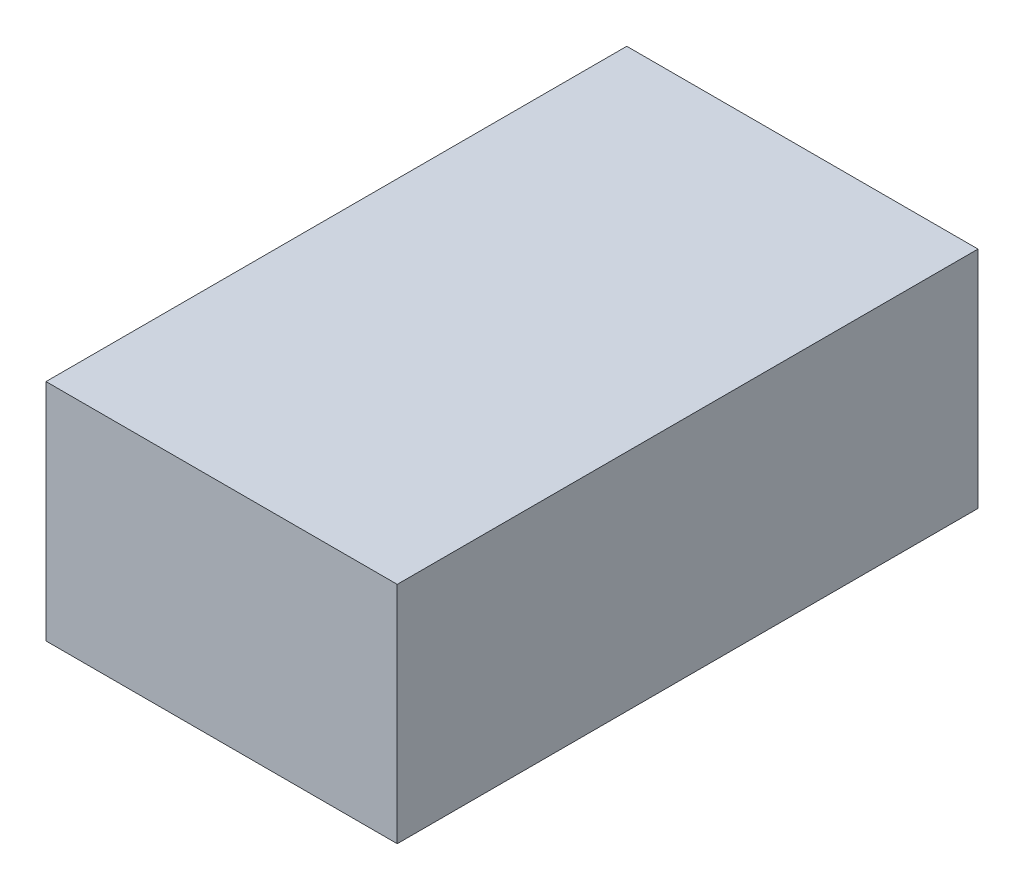
ISO-10303-21;
HEADER;
FILE_DESCRIPTION(('STEP AP214'),'2;1');
FILE_NAME('part.step','',(''),(''),'','','');
FILE_SCHEMA(('AUTOMOTIVE_DESIGN { 1 0 10303 214 1 1 1 1 }'));
ENDSEC;
DATA;
#1=APPLICATION_CONTEXT('core data for automotive mechanical design processes');
#2=APPLICATION_PROTOCOL_DEFINITION('international standard','automotive_design',2000,#1);
#3=PRODUCT_CONTEXT('',#1,'mechanical');
#4=PRODUCT('Part','Part','',(#3));
#5=PRODUCT_RELATED_PRODUCT_CATEGORY('part','',(#4));
#6=PRODUCT_DEFINITION_FORMATION('','',#4);
#7=PRODUCT_DEFINITION_CONTEXT('part definition',#1,'design');
#8=PRODUCT_DEFINITION('design','',#6,#7);
#9=PRODUCT_DEFINITION_SHAPE('','',#8);
#10=(LENGTH_UNIT() NAMED_UNIT(*) SI_UNIT(.MILLI.,.METRE.));
#11=(NAMED_UNIT(*) PLANE_ANGLE_UNIT() SI_UNIT($,.RADIAN.));
#12=(NAMED_UNIT(*) SI_UNIT($,.STERADIAN.) SOLID_ANGLE_UNIT());
#13=UNCERTAINTY_MEASURE_WITH_UNIT(LENGTH_MEASURE(1.E-05),#10,'distance_accuracy_value','');
#14=(GEOMETRIC_REPRESENTATION_CONTEXT(3) GLOBAL_UNCERTAINTY_ASSIGNED_CONTEXT((#13)) GLOBAL_UNIT_ASSIGNED_CONTEXT((#10,
#11,#12)) REPRESENTATION_CONTEXT('',''));
#15=CARTESIAN_POINT('',(0.,0.,0.));
#16=DIRECTION('',(0.,0.,1.));
#17=DIRECTION('',(1.,0.,0.));
#18=AXIS2_PLACEMENT_3D('',#15,#16,#17);
#19=CARTESIAN_POINT('',(160.267862505363,-105.,-500.));
#20=DIRECTION('',(1.,0.,0.));
#21=DIRECTION('',(0.,0.,-1.));
#22=AXIS2_PLACEMENT_3D('',#19,#20,#21);
#23=PLANE('',#22);
#24=DIRECTION('',(0.,1.,0.));
#25=VECTOR('',#24,1.);
#26=CARTESIAN_POINT('',(160.267862505363,-105.,30.));
#27=LINE('',#26,#25);
#28=CARTESIAN_POINT('',(160.267862505363,-105.,30.));
#29=VERTEX_POINT('',#28);
#30=CARTESIAN_POINT('',(160.267862505363,100.006558649359,30.));
#31=VERTEX_POINT('',#30);
#32=EDGE_CURVE('E140',#29,#31,#27,.T.);
#33=ORIENTED_EDGE('',*,*,#32,.F.);
#34=DIRECTION('',(0.,0.,1.));
#35=VECTOR('',#34,1.);
#36=CARTESIAN_POINT('',(160.267862505363,-105.,-500.));
#37=LINE('',#36,#35);
#38=CARTESIAN_POINT('',(160.267862505363,-105.,-500.));
#39=VERTEX_POINT('',#38);
#40=EDGE_CURVE('E11',#39,#29,#37,.T.);
#41=ORIENTED_EDGE('',*,*,#40,.F.);
#42=DIRECTION('',(0.,1.,0.));
#43=VECTOR('',#42,1.);
#44=CARTESIAN_POINT('',(160.267862505363,-105.,-500.));
#45=LINE('',#44,#43);
#46=CARTESIAN_POINT('',(160.267862505363,100.006558649359,-500.));
#47=VERTEX_POINT('',#46);
#48=EDGE_CURVE('E144',#39,#47,#45,.T.);
#49=ORIENTED_EDGE('',*,*,#48,.T.);
#50=DIRECTION('',(0.,0.,1.));
#51=VECTOR('',#50,1.);
#52=CARTESIAN_POINT('',(160.267862505363,100.006558649359,-500.));
#53=LINE('',#52,#51);
#54=EDGE_CURVE('E36',#47,#31,#53,.T.);
#55=ORIENTED_EDGE('',*,*,#54,.T.);
#56=EDGE_LOOP('',(#33,#41,#49,#55));
#57=FACE_BOUND('',#56,.T.);
#58=ADVANCED_FACE('F33',(#57),#23,.T.);
#59=CARTESIAN_POINT('',(160.267862505363,-105.,-500.));
#60=DIRECTION('',(0.,-1.,0.));
#61=DIRECTION('',(0.,0.,-1.));
#62=AXIS2_PLACEMENT_3D('',#59,#60,#61);
#63=PLANE('',#62);
#64=DIRECTION('',(0.,0.,-1.));
#65=VECTOR('',#64,1.);
#66=CARTESIAN_POINT('',(-130.267862505363,-105.,0.));
#67=LINE('',#66,#65);
#68=CARTESIAN_POINT('',(-130.267862505363,-105.,0.));
#69=VERTEX_POINT('',#68);
#70=CARTESIAN_POINT('',(-130.267862505363,-105.,-470.));
#71=VERTEX_POINT('',#70);
#72=EDGE_CURVE('E49',#69,#71,#67,.T.);
#73=ORIENTED_EDGE('',*,*,#72,.F.);
#74=DIRECTION('',(-1.,0.,0.));
#75=VECTOR('',#74,1.);
#76=CARTESIAN_POINT('',(-130.267862505363,-105.,0.));
#77=LINE('',#76,#75);
#78=CARTESIAN_POINT('',(130.272137494637,-105.,0.));
#79=VERTEX_POINT('',#78);
#80=EDGE_CURVE('E125',#79,#69,#77,.T.);
#81=ORIENTED_EDGE('',*,*,#80,.F.);
#82=DIRECTION('',(0.,0.,1.));
#83=VECTOR('',#82,1.);
#84=CARTESIAN_POINT('',(130.272137494637,-105.,0.));
#85=LINE('',#84,#83);
#86=CARTESIAN_POINT('',(130.272137494637,-105.,-470.));
#87=VERTEX_POINT('',#86);
#88=EDGE_CURVE('E128',#87,#79,#85,.T.);
#89=ORIENTED_EDGE('',*,*,#88,.F.);
#90=DIRECTION('',(1.,0.,0.));
#91=VECTOR('',#90,1.);
#92=CARTESIAN_POINT('',(-130.267862505363,-105.,-470.));
#93=LINE('',#92,#91);
#94=EDGE_CURVE('E134',#71,#87,#93,.T.);
#95=ORIENTED_EDGE('',*,*,#94,.F.);
#96=EDGE_LOOP('',(#73,#81,#89,#95));
#97=FACE_BOUND('',#96,.T.);
#98=DIRECTION('',(1.,0.,0.));
#99=VECTOR('',#98,1.);
#100=CARTESIAN_POINT('',(160.267862505363,-105.,30.));
#101=LINE('',#100,#99);
#102=CARTESIAN_POINT('',(-160.267862505363,-105.,30.));
#103=VERTEX_POINT('',#102);
#104=EDGE_CURVE('E147',#103,#29,#101,.T.);
#105=ORIENTED_EDGE('',*,*,#104,.F.);
#106=DIRECTION('',(0.,0.,1.));
#107=VECTOR('',#106,1.);
#108=CARTESIAN_POINT('',(-160.267862505363,-105.,-500.));
#109=LINE('',#108,#107);
#110=CARTESIAN_POINT('',(-160.267862505363,-105.,-500.));
#111=VERTEX_POINT('',#110);
#112=EDGE_CURVE('E41',#111,#103,#109,.T.);
#113=ORIENTED_EDGE('',*,*,#112,.F.);
#114=DIRECTION('',(1.,0.,0.));
#115=VECTOR('',#114,1.);
#116=CARTESIAN_POINT('',(160.267862505363,-105.,-500.));
#117=LINE('',#116,#115);
#118=EDGE_CURVE('E152',#111,#39,#117,.T.);
#119=ORIENTED_EDGE('',*,*,#118,.T.);
#120=ORIENTED_EDGE('',*,*,#40,.T.);
#121=EDGE_LOOP('',(#105,#113,#119,#120));
#122=FACE_BOUND('',#121,.T.);
#123=ADVANCED_FACE('F169',(#97,#122),#63,.T.);
#124=CARTESIAN_POINT('',(-160.267862505363,-105.,-500.));
#125=DIRECTION('',(-1.,0.,0.));
#126=DIRECTION('',(0.,0.,1.));
#127=AXIS2_PLACEMENT_3D('',#124,#125,#126);
#128=PLANE('',#127);
#129=DIRECTION('',(0.,-1.,0.));
#130=VECTOR('',#129,1.);
#131=CARTESIAN_POINT('',(-160.267862505363,-105.,30.));
#132=LINE('',#131,#130);
#133=CARTESIAN_POINT('',(-160.267862505363,100.006558649359,30.));
#134=VERTEX_POINT('',#133);
#135=EDGE_CURVE('E159',#134,#103,#132,.T.);
#136=ORIENTED_EDGE('',*,*,#135,.F.);
#137=DIRECTION('',(0.,0.,1.));
#138=VECTOR('',#137,1.);
#139=CARTESIAN_POINT('',(-160.267862505363,100.006558649359,-500.));
#140=LINE('',#139,#138);
#141=CARTESIAN_POINT('',(-160.267862505363,100.006558649359,-500.));
#142=VERTEX_POINT('',#141);
#143=EDGE_CURVE('E164',#142,#134,#140,.T.);
#144=ORIENTED_EDGE('',*,*,#143,.F.);
#145=DIRECTION('',(0.,-1.,0.));
#146=VECTOR('',#145,1.);
#147=CARTESIAN_POINT('',(-160.267862505363,-105.,-500.));
#148=LINE('',#147,#146);
#149=EDGE_CURVE('E149',#142,#111,#148,.T.);
#150=ORIENTED_EDGE('',*,*,#149,.T.);
#151=ORIENTED_EDGE('',*,*,#112,.T.);
#152=EDGE_LOOP('',(#136,#144,#150,#151));
#153=FACE_BOUND('',#152,.T.);
#154=ADVANCED_FACE('F173',(#153),#128,.T.);
#155=CARTESIAN_POINT('',(160.267862505363,100.006558649359,-500.));
#156=DIRECTION('',(0.,1.,0.));
#157=DIRECTION('',(0.,0.,1.));
#158=AXIS2_PLACEMENT_3D('',#155,#156,#157);
#159=PLANE('',#158);
#160=DIRECTION('',(-1.,0.,0.));
#161=VECTOR('',#160,1.);
#162=CARTESIAN_POINT('',(160.267862505363,100.006558649359,30.));
#163=LINE('',#162,#161);
#164=EDGE_CURVE('E156',#31,#134,#163,.T.);
#165=ORIENTED_EDGE('',*,*,#164,.F.);
#166=ORIENTED_EDGE('',*,*,#54,.F.);
#167=DIRECTION('',(-1.,0.,0.));
#168=VECTOR('',#167,1.);
#169=CARTESIAN_POINT('',(160.267862505363,100.006558649359,-500.));
#170=LINE('',#169,#168);
#171=EDGE_CURVE('E146',#47,#142,#170,.T.);
#172=ORIENTED_EDGE('',*,*,#171,.T.);
#173=ORIENTED_EDGE('',*,*,#143,.T.);
#174=EDGE_LOOP('',(#165,#166,#172,#173));
#175=FACE_BOUND('',#174,.T.);
#176=ADVANCED_FACE('F166',(#175),#159,.T.);
#177=CARTESIAN_POINT('',(0.,0.,-500.));
#178=DIRECTION('',(0.,0.,1.));
#179=DIRECTION('',(1.,0.,0.));
#180=AXIS2_PLACEMENT_3D('',#177,#178,#179);
#181=PLANE('',#180);
#182=ORIENTED_EDGE('',*,*,#48,.F.);
#183=ORIENTED_EDGE('',*,*,#118,.F.);
#184=ORIENTED_EDGE('',*,*,#149,.F.);
#185=ORIENTED_EDGE('',*,*,#171,.F.);
#186=EDGE_LOOP('',(#182,#183,#184,#185));
#187=FACE_BOUND('',#186,.T.);
#188=ADVANCED_FACE('F175',(#187),#181,.F.);
#189=CARTESIAN_POINT('',(0.,0.,30.));
#190=DIRECTION('',(0.,0.,1.));
#191=DIRECTION('',(1.,0.,0.));
#192=AXIS2_PLACEMENT_3D('',#189,#190,#191);
#193=PLANE('',#192);
#194=ORIENTED_EDGE('',*,*,#32,.T.);
#195=ORIENTED_EDGE('',*,*,#164,.T.);
#196=ORIENTED_EDGE('',*,*,#135,.T.);
#197=ORIENTED_EDGE('',*,*,#104,.T.);
#198=EDGE_LOOP('',(#194,#195,#196,#197));
#199=FACE_BOUND('',#198,.T.);
#200=ADVANCED_FACE('F168',(#199),#193,.T.);
#201=CARTESIAN_POINT('',(-130.267862505363,-75.,0.));
#202=DIRECTION('',(-1.,0.,0.));
#203=DIRECTION('',(0.,0.,1.));
#204=AXIS2_PLACEMENT_3D('',#201,#202,#203);
#205=PLANE('',#204);
#206=ORIENTED_EDGE('',*,*,#72,.T.);
#207=DIRECTION('',(0.,-1.,0.));
#208=VECTOR('',#207,1.);
#209=CARTESIAN_POINT('',(-130.267862505363,-75.,-470.));
#210=LINE('',#209,#208);
#211=CARTESIAN_POINT('',(-130.267862505363,-75.,-470.));
#212=VERTEX_POINT('',#211);
#213=EDGE_CURVE('E103',#212,#71,#210,.T.);
#214=ORIENTED_EDGE('',*,*,#213,.F.);
#215=DIRECTION('',(0.,0.,-1.));
#216=VECTOR('',#215,1.);
#217=CARTESIAN_POINT('',(-130.267862505363,-75.,0.));
#218=LINE('',#217,#216);
#219=CARTESIAN_POINT('',(-130.267862505363,-75.,0.));
#220=VERTEX_POINT('',#219);
#221=EDGE_CURVE('E107',#220,#212,#218,.T.);
#222=ORIENTED_EDGE('',*,*,#221,.F.);
#223=DIRECTION('',(0.,-1.,0.));
#224=VECTOR('',#223,1.);
#225=CARTESIAN_POINT('',(-130.267862505363,-75.,0.));
#226=LINE('',#225,#224);
#227=EDGE_CURVE('E138',#220,#69,#226,.T.);
#228=ORIENTED_EDGE('',*,*,#227,.T.);
#229=EDGE_LOOP('',(#206,#214,#222,#228));
#230=FACE_BOUND('',#229,.T.);
#231=ADVANCED_FACE('F105',(#230),#205,.F.);
#232=CARTESIAN_POINT('',(-130.267862505363,-75.,0.));
#233=DIRECTION('',(0.,0.,1.));
#234=DIRECTION('',(1.,0.,0.));
#235=AXIS2_PLACEMENT_3D('',#232,#233,#234);
#236=PLANE('',#235);
#237=ORIENTED_EDGE('',*,*,#80,.T.);
#238=ORIENTED_EDGE('',*,*,#227,.F.);
#239=DIRECTION('',(-1.,0.,0.));
#240=VECTOR('',#239,1.);
#241=CARTESIAN_POINT('',(-130.267862505363,-75.,0.));
#242=LINE('',#241,#240);
#243=CARTESIAN_POINT('',(130.272137494637,-75.,0.));
#244=VERTEX_POINT('',#243);
#245=EDGE_CURVE('E113',#244,#220,#242,.T.);
#246=ORIENTED_EDGE('',*,*,#245,.F.);
#247=DIRECTION('',(0.,-1.,0.));
#248=VECTOR('',#247,1.);
#249=CARTESIAN_POINT('',(130.272137494637,-75.,0.));
#250=LINE('',#249,#248);
#251=EDGE_CURVE('E141',#244,#79,#250,.T.);
#252=ORIENTED_EDGE('',*,*,#251,.T.);
#253=EDGE_LOOP('',(#237,#238,#246,#252));
#254=FACE_BOUND('',#253,.T.);
#255=ADVANCED_FACE('F199',(#254),#236,.F.);
#256=CARTESIAN_POINT('',(130.272137494637,-75.,0.));
#257=DIRECTION('',(1.,0.,0.));
#258=DIRECTION('',(0.,0.,-1.));
#259=AXIS2_PLACEMENT_3D('',#256,#257,#258);
#260=PLANE('',#259);
#261=ORIENTED_EDGE('',*,*,#88,.T.);
#262=ORIENTED_EDGE('',*,*,#251,.F.);
#263=DIRECTION('',(0.,0.,1.));
#264=VECTOR('',#263,1.);
#265=CARTESIAN_POINT('',(130.272137494637,-75.,0.));
#266=LINE('',#265,#264);
#267=CARTESIAN_POINT('',(130.272137494637,-75.,-470.));
#268=VERTEX_POINT('',#267);
#269=EDGE_CURVE('E121',#268,#244,#266,.T.);
#270=ORIENTED_EDGE('',*,*,#269,.F.);
#271=DIRECTION('',(0.,-1.,0.));
#272=VECTOR('',#271,1.);
#273=CARTESIAN_POINT('',(130.272137494637,-75.,-470.));
#274=LINE('',#273,#272);
#275=EDGE_CURVE('E112',#268,#87,#274,.T.);
#276=ORIENTED_EDGE('',*,*,#275,.T.);
#277=EDGE_LOOP('',(#261,#262,#270,#276));
#278=FACE_BOUND('',#277,.T.);
#279=ADVANCED_FACE('F197',(#278),#260,.F.);
#280=CARTESIAN_POINT('',(-130.267862505363,-75.,-470.));
#281=DIRECTION('',(0.,0.,-1.));
#282=DIRECTION('',(-1.,0.,0.));
#283=AXIS2_PLACEMENT_3D('',#280,#281,#282);
#284=PLANE('',#283);
#285=ORIENTED_EDGE('',*,*,#94,.T.);
#286=ORIENTED_EDGE('',*,*,#275,.F.);
#287=DIRECTION('',(1.,0.,0.));
#288=VECTOR('',#287,1.);
#289=CARTESIAN_POINT('',(-130.267862505363,-75.,-470.));
#290=LINE('',#289,#288);
#291=EDGE_CURVE('E116',#212,#268,#290,.T.);
#292=ORIENTED_EDGE('',*,*,#291,.F.);
#293=ORIENTED_EDGE('',*,*,#213,.T.);
#294=EDGE_LOOP('',(#285,#286,#292,#293));
#295=FACE_BOUND('',#294,.T.);
#296=ADVANCED_FACE('F117',(#295),#284,.F.);
#297=CARTESIAN_POINT('',(0.,-75.,0.));
#298=DIRECTION('',(0.,-1.,0.));
#299=DIRECTION('',(0.,0.,-1.));
#300=AXIS2_PLACEMENT_3D('',#297,#298,#299);
#301=PLANE('',#300);
#302=ORIENTED_EDGE('',*,*,#221,.T.);
#303=ORIENTED_EDGE('',*,*,#291,.T.);
#304=ORIENTED_EDGE('',*,*,#269,.T.);
#305=ORIENTED_EDGE('',*,*,#245,.T.);
#306=EDGE_LOOP('',(#302,#303,#304,#305));
#307=FACE_BOUND('',#306,.T.);
#308=ADVANCED_FACE('F123',(#307),#301,.T.);
#309=CLOSED_SHELL('',(#58,#123,#154,#176,#188,#200,#231,#255,#279,#296,#308));
#310=MANIFOLD_SOLID_BREP('B2',#309);
#311=ADVANCED_BREP_SHAPE_REPRESENTATION('',(#18,#310),#14);
#312=SHAPE_DEFINITION_REPRESENTATION(#9,#311);
ENDSEC;
END-ISO-10303-21;
